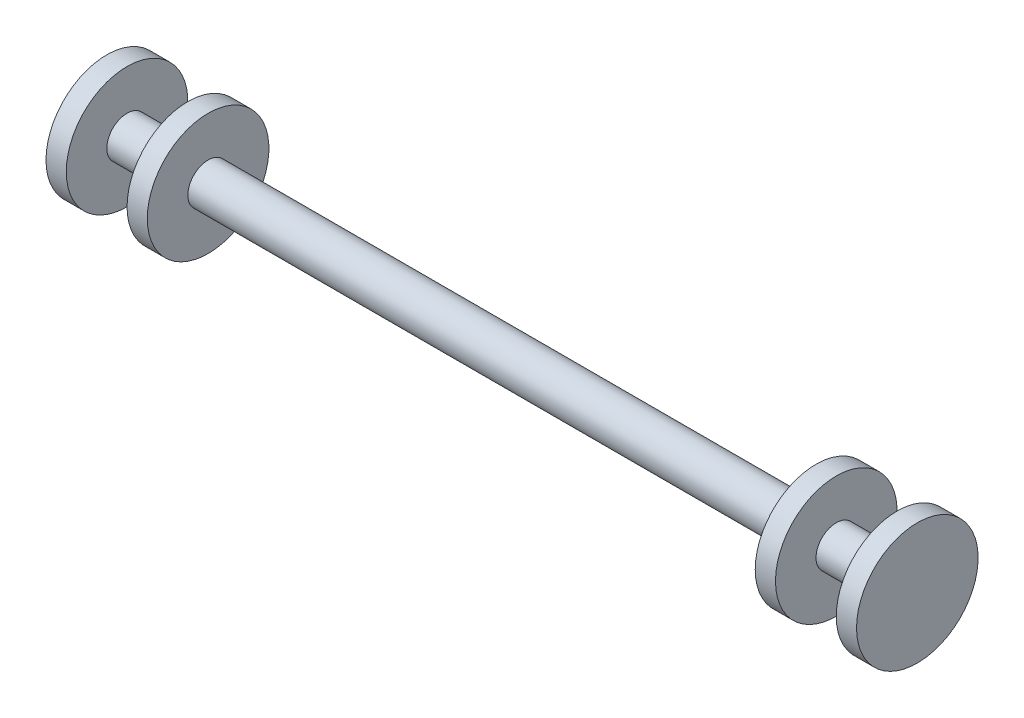
ISO-10303-21;
HEADER;
FILE_DESCRIPTION(('STEP AP214'),'2;1');
FILE_NAME('part.step','',(''),(''),'','','');
FILE_SCHEMA(('AUTOMOTIVE_DESIGN { 1 0 10303 214 1 1 1 1 }'));
ENDSEC;
DATA;
#1=APPLICATION_CONTEXT('core data for automotive mechanical design processes');
#2=APPLICATION_PROTOCOL_DEFINITION('international standard','automotive_design',2000,#1);
#3=PRODUCT_CONTEXT('',#1,'mechanical');
#4=PRODUCT('Part','Part','',(#3));
#5=PRODUCT_RELATED_PRODUCT_CATEGORY('part','',(#4));
#6=PRODUCT_DEFINITION_FORMATION('','',#4);
#7=PRODUCT_DEFINITION_CONTEXT('part definition',#1,'design');
#8=PRODUCT_DEFINITION('design','',#6,#7);
#9=PRODUCT_DEFINITION_SHAPE('','',#8);
#10=(LENGTH_UNIT() NAMED_UNIT(*) SI_UNIT(.MILLI.,.METRE.));
#11=(NAMED_UNIT(*) PLANE_ANGLE_UNIT() SI_UNIT($,.RADIAN.));
#12=(NAMED_UNIT(*) SI_UNIT($,.STERADIAN.) SOLID_ANGLE_UNIT());
#13=UNCERTAINTY_MEASURE_WITH_UNIT(LENGTH_MEASURE(1.E-05),#10,'distance_accuracy_value','');
#14=(GEOMETRIC_REPRESENTATION_CONTEXT(3) GLOBAL_UNCERTAINTY_ASSIGNED_CONTEXT((#13)) GLOBAL_UNIT_ASSIGNED_CONTEXT((#10,
#11,#12)) REPRESENTATION_CONTEXT('',''));
#15=CARTESIAN_POINT('',(0.,0.,0.));
#16=DIRECTION('',(0.,0.,1.));
#17=DIRECTION('',(1.,0.,0.));
#18=AXIS2_PLACEMENT_3D('',#15,#16,#17);
#19=CARTESIAN_POINT('',(-40.,4.,0.));
#20=DIRECTION('',(1.,0.,0.));
#21=DIRECTION('',(0.,0.,-1.));
#22=AXIS2_PLACEMENT_3D('',#19,#20,#21);
#23=PLANE('',#22);
#24=CARTESIAN_POINT('',(-40.,-2.00000000000001,0.));
#25=DIRECTION('',(-1.,0.,0.));
#26=DIRECTION('',(0.,0.,1.));
#27=AXIS2_PLACEMENT_3D('',#24,#25,#26);
#28=CIRCLE('',#27,6.00000000000001);
#29=CARTESIAN_POINT('',(-40.,-2.00000000000001,6.00000000000001));
#30=VERTEX_POINT('',#29);
#31=EDGE_CURVE('E10',#30,#30,#28,.T.);
#32=ORIENTED_EDGE('',*,*,#31,.T.);
#33=EDGE_LOOP('',(#32));
#34=FACE_BOUND('',#33,.T.);
#35=ADVANCED_FACE('F35',(#34),#23,.F.);
#36=CARTESIAN_POINT('',(-40.,-2.00000000000001,0.));
#37=DIRECTION('',(-1.,0.,0.));
#38=DIRECTION('',(0.,0.,1.));
#39=AXIS2_PLACEMENT_3D('',#36,#37,#38);
#40=CYLINDRICAL_SURFACE('',#39,6.00000000000001);
#41=ORIENTED_EDGE('',*,*,#31,.F.);
#42=EDGE_LOOP('',(#41));
#43=FACE_BOUND('',#42,.T.);
#44=CARTESIAN_POINT('',(-38.,-2.00000000000001,0.));
#45=DIRECTION('',(-1.,0.,0.));
#46=DIRECTION('',(0.,0.,1.));
#47=AXIS2_PLACEMENT_3D('',#44,#45,#46);
#48=CIRCLE('',#47,6.00000000000001);
#49=CARTESIAN_POINT('',(-38.,-2.00000000000001,6.00000000000001));
#50=VERTEX_POINT('',#49);
#51=EDGE_CURVE('E41',#50,#50,#48,.T.);
#52=ORIENTED_EDGE('',*,*,#51,.T.);
#53=EDGE_LOOP('',(#52));
#54=FACE_BOUND('',#53,.T.);
#55=ADVANCED_FACE('F97',(#43,#54),#40,.T.);
#56=CARTESIAN_POINT('',(-38.,0.,0.));
#57=DIRECTION('',(-1.,0.,0.));
#58=DIRECTION('',(0.,0.,1.));
#59=AXIS2_PLACEMENT_3D('',#56,#57,#58);
#60=PLANE('',#59);
#61=ORIENTED_EDGE('',*,*,#51,.F.);
#62=EDGE_LOOP('',(#61));
#63=FACE_BOUND('',#62,.T.);
#64=CARTESIAN_POINT('',(-38.,-2.00000000000001,0.));
#65=DIRECTION('',(-1.,0.,0.));
#66=DIRECTION('',(0.,0.,1.));
#67=AXIS2_PLACEMENT_3D('',#64,#65,#66);
#68=CIRCLE('',#67,2.00000000000001);
#69=CARTESIAN_POINT('',(-38.,-2.00000000000001,2.00000000000001));
#70=VERTEX_POINT('',#69);
#71=EDGE_CURVE('E45',#70,#70,#68,.T.);
#72=ORIENTED_EDGE('',*,*,#71,.T.);
#73=EDGE_LOOP('',(#72));
#74=FACE_BOUND('',#73,.T.);
#75=ADVANCED_FACE('F101',(#63,#74),#60,.F.);
#76=CARTESIAN_POINT('',(-40.,-2.00000000000001,0.));
#77=DIRECTION('',(-1.,0.,0.));
#78=DIRECTION('',(0.,0.,1.));
#79=AXIS2_PLACEMENT_3D('',#76,#77,#78);
#80=CYLINDRICAL_SURFACE('',#79,2.00000000000001);
#81=ORIENTED_EDGE('',*,*,#71,.F.);
#82=EDGE_LOOP('',(#81));
#83=FACE_BOUND('',#82,.T.);
#84=CARTESIAN_POINT('',(-32.,-2.00000000000001,0.));
#85=DIRECTION('',(-1.,0.,0.));
#86=DIRECTION('',(0.,0.,1.));
#87=AXIS2_PLACEMENT_3D('',#84,#85,#86);
#88=CIRCLE('',#87,2.00000000000001);
#89=CARTESIAN_POINT('',(-32.,-2.00000000000001,2.00000000000001));
#90=VERTEX_POINT('',#89);
#91=EDGE_CURVE('E49',#90,#90,#88,.T.);
#92=ORIENTED_EDGE('',*,*,#91,.T.);
#93=EDGE_LOOP('',(#92));
#94=FACE_BOUND('',#93,.T.);
#95=ADVANCED_FACE('F106',(#83,#94),#80,.T.);
#96=CARTESIAN_POINT('',(-32.,4.,0.));
#97=DIRECTION('',(1.,0.,0.));
#98=DIRECTION('',(0.,0.,-1.));
#99=AXIS2_PLACEMENT_3D('',#96,#97,#98);
#100=PLANE('',#99);
#101=ORIENTED_EDGE('',*,*,#91,.F.);
#102=EDGE_LOOP('',(#101));
#103=FACE_BOUND('',#102,.T.);
#104=CARTESIAN_POINT('',(-32.,-2.00000000000001,0.));
#105=DIRECTION('',(-1.,0.,0.));
#106=DIRECTION('',(0.,0.,1.));
#107=AXIS2_PLACEMENT_3D('',#104,#105,#106);
#108=CIRCLE('',#107,6.00000000000001);
#109=CARTESIAN_POINT('',(-32.,-2.00000000000001,6.00000000000001));
#110=VERTEX_POINT('',#109);
#111=EDGE_CURVE('E54',#110,#110,#108,.T.);
#112=ORIENTED_EDGE('',*,*,#111,.T.);
#113=EDGE_LOOP('',(#112));
#114=FACE_BOUND('',#113,.T.);
#115=ADVANCED_FACE('F112',(#103,#114),#100,.F.);
#116=CARTESIAN_POINT('',(-40.,-2.00000000000001,0.));
#117=DIRECTION('',(-1.,0.,0.));
#118=DIRECTION('',(0.,0.,1.));
#119=AXIS2_PLACEMENT_3D('',#116,#117,#118);
#120=CYLINDRICAL_SURFACE('',#119,6.00000000000001);
#121=ORIENTED_EDGE('',*,*,#111,.F.);
#122=EDGE_LOOP('',(#121));
#123=FACE_BOUND('',#122,.T.);
#124=CARTESIAN_POINT('',(-30.,-2.00000000000001,0.));
#125=DIRECTION('',(-1.,0.,0.));
#126=DIRECTION('',(0.,0.,1.));
#127=AXIS2_PLACEMENT_3D('',#124,#125,#126);
#128=CIRCLE('',#127,6.00000000000001);
#129=CARTESIAN_POINT('',(-30.,-2.00000000000001,6.00000000000001));
#130=VERTEX_POINT('',#129);
#131=EDGE_CURVE('E57',#130,#130,#128,.T.);
#132=ORIENTED_EDGE('',*,*,#131,.T.);
#133=EDGE_LOOP('',(#132));
#134=FACE_BOUND('',#133,.T.);
#135=ADVANCED_FACE('F116',(#123,#134),#120,.T.);
#136=CARTESIAN_POINT('',(-30.,0.,0.));
#137=DIRECTION('',(-1.,0.,0.));
#138=DIRECTION('',(0.,0.,1.));
#139=AXIS2_PLACEMENT_3D('',#136,#137,#138);
#140=PLANE('',#139);
#141=ORIENTED_EDGE('',*,*,#131,.F.);
#142=EDGE_LOOP('',(#141));
#143=FACE_BOUND('',#142,.T.);
#144=CARTESIAN_POINT('',(-30.,-2.00000000000001,0.));
#145=DIRECTION('',(-1.,0.,0.));
#146=DIRECTION('',(0.,0.,1.));
#147=AXIS2_PLACEMENT_3D('',#144,#145,#146);
#148=CIRCLE('',#147,2.);
#149=CARTESIAN_POINT('',(-30.,-2.00000000000001,2.));
#150=VERTEX_POINT('',#149);
#151=EDGE_CURVE('E60',#150,#150,#148,.T.);
#152=ORIENTED_EDGE('',*,*,#151,.T.);
#153=EDGE_LOOP('',(#152));
#154=FACE_BOUND('',#153,.T.);
#155=ADVANCED_FACE('F120',(#143,#154),#140,.F.);
#156=CARTESIAN_POINT('',(-40.,-2.00000000000001,0.));
#157=DIRECTION('',(-1.,0.,0.));
#158=DIRECTION('',(0.,0.,1.));
#159=AXIS2_PLACEMENT_3D('',#156,#157,#158);
#160=CYLINDRICAL_SURFACE('',#159,2.00000000000001);
#161=ORIENTED_EDGE('',*,*,#151,.F.);
#162=EDGE_LOOP('',(#161));
#163=FACE_BOUND('',#162,.T.);
#164=CARTESIAN_POINT('',(30.,-2.00000000000001,0.));
#165=DIRECTION('',(-1.,0.,0.));
#166=DIRECTION('',(0.,0.,1.));
#167=AXIS2_PLACEMENT_3D('',#164,#165,#166);
#168=CIRCLE('',#167,2.00000000000002);
#169=CARTESIAN_POINT('',(30.,-2.00000000000001,2.00000000000002));
#170=VERTEX_POINT('',#169);
#171=EDGE_CURVE('E63',#170,#170,#168,.T.);
#172=ORIENTED_EDGE('',*,*,#171,.T.);
#173=EDGE_LOOP('',(#172));
#174=FACE_BOUND('',#173,.T.);
#175=ADVANCED_FACE('F124',(#163,#174),#160,.T.);
#176=CARTESIAN_POINT('',(30.,0.,0.));
#177=DIRECTION('',(-1.,0.,0.));
#178=DIRECTION('',(0.,0.,1.));
#179=AXIS2_PLACEMENT_3D('',#176,#177,#178);
#180=PLANE('',#179);
#181=CARTESIAN_POINT('',(30.,-2.00000000000001,0.));
#182=DIRECTION('',(-1.,0.,0.));
#183=DIRECTION('',(0.,0.,1.));
#184=AXIS2_PLACEMENT_3D('',#181,#182,#183);
#185=CIRCLE('',#184,6.00000000000001);
#186=CARTESIAN_POINT('',(30.,-2.00000000000001,6.00000000000001));
#187=VERTEX_POINT('',#186);
#188=EDGE_CURVE('E66',#187,#187,#185,.T.);
#189=ORIENTED_EDGE('',*,*,#188,.T.);
#190=EDGE_LOOP('',(#189));
#191=FACE_BOUND('',#190,.T.);
#192=ORIENTED_EDGE('',*,*,#171,.F.);
#193=EDGE_LOOP('',(#192));
#194=FACE_BOUND('',#193,.T.);
#195=ADVANCED_FACE('F128',(#191,#194),#180,.T.);
#196=CARTESIAN_POINT('',(-40.,-2.00000000000001,0.));
#197=DIRECTION('',(-1.,0.,0.));
#198=DIRECTION('',(0.,0.,1.));
#199=AXIS2_PLACEMENT_3D('',#196,#197,#198);
#200=CYLINDRICAL_SURFACE('',#199,6.00000000000001);
#201=CARTESIAN_POINT('',(32.,-2.00000000000001,0.));
#202=DIRECTION('',(-1.,0.,0.));
#203=DIRECTION('',(0.,0.,1.));
#204=AXIS2_PLACEMENT_3D('',#201,#202,#203);
#205=CIRCLE('',#204,6.00000000000001);
#206=CARTESIAN_POINT('',(32.,-2.00000000000001,6.00000000000001));
#207=VERTEX_POINT('',#206);
#208=EDGE_CURVE('E69',#207,#207,#205,.T.);
#209=ORIENTED_EDGE('',*,*,#208,.T.);
#210=EDGE_LOOP('',(#209));
#211=FACE_BOUND('',#210,.T.);
#212=ORIENTED_EDGE('',*,*,#188,.F.);
#213=EDGE_LOOP('',(#212));
#214=FACE_BOUND('',#213,.T.);
#215=ADVANCED_FACE('F132',(#211,#214),#200,.T.);
#216=CARTESIAN_POINT('',(32.,4.,0.));
#217=DIRECTION('',(1.,0.,0.));
#218=DIRECTION('',(0.,0.,-1.));
#219=AXIS2_PLACEMENT_3D('',#216,#217,#218);
#220=PLANE('',#219);
#221=CARTESIAN_POINT('',(32.,-2.00000000000001,0.));
#222=DIRECTION('',(-1.,0.,0.));
#223=DIRECTION('',(0.,0.,1.));
#224=AXIS2_PLACEMENT_3D('',#221,#222,#223);
#225=CIRCLE('',#224,2.00000000000001);
#226=CARTESIAN_POINT('',(32.,-2.00000000000001,2.00000000000001));
#227=VERTEX_POINT('',#226);
#228=EDGE_CURVE('E72',#227,#227,#225,.T.);
#229=ORIENTED_EDGE('',*,*,#228,.T.);
#230=EDGE_LOOP('',(#229));
#231=FACE_BOUND('',#230,.T.);
#232=ORIENTED_EDGE('',*,*,#208,.F.);
#233=EDGE_LOOP('',(#232));
#234=FACE_BOUND('',#233,.T.);
#235=ADVANCED_FACE('F136',(#231,#234),#220,.T.);
#236=CARTESIAN_POINT('',(-40.,-2.00000000000001,0.));
#237=DIRECTION('',(-1.,0.,0.));
#238=DIRECTION('',(0.,0.,1.));
#239=AXIS2_PLACEMENT_3D('',#236,#237,#238);
#240=CYLINDRICAL_SURFACE('',#239,2.00000000000001);
#241=CARTESIAN_POINT('',(38.,-2.00000000000001,0.));
#242=DIRECTION('',(-1.,0.,0.));
#243=DIRECTION('',(0.,0.,1.));
#244=AXIS2_PLACEMENT_3D('',#241,#242,#243);
#245=CIRCLE('',#244,2.00000000000001);
#246=CARTESIAN_POINT('',(38.,-2.00000000000001,2.00000000000001));
#247=VERTEX_POINT('',#246);
#248=EDGE_CURVE('E75',#247,#247,#245,.T.);
#249=ORIENTED_EDGE('',*,*,#248,.T.);
#250=EDGE_LOOP('',(#249));
#251=FACE_BOUND('',#250,.T.);
#252=ORIENTED_EDGE('',*,*,#228,.F.);
#253=EDGE_LOOP('',(#252));
#254=FACE_BOUND('',#253,.T.);
#255=ADVANCED_FACE('F140',(#251,#254),#240,.T.);
#256=CARTESIAN_POINT('',(38.,0.,0.));
#257=DIRECTION('',(-1.,0.,0.));
#258=DIRECTION('',(0.,0.,1.));
#259=AXIS2_PLACEMENT_3D('',#256,#257,#258);
#260=PLANE('',#259);
#261=CARTESIAN_POINT('',(38.,-2.00000000000001,0.));
#262=DIRECTION('',(-1.,0.,0.));
#263=DIRECTION('',(0.,0.,1.));
#264=AXIS2_PLACEMENT_3D('',#261,#262,#263);
#265=CIRCLE('',#264,6.00000000000001);
#266=CARTESIAN_POINT('',(38.,-2.00000000000001,6.00000000000001));
#267=VERTEX_POINT('',#266);
#268=EDGE_CURVE('E78',#267,#267,#265,.T.);
#269=ORIENTED_EDGE('',*,*,#268,.T.);
#270=EDGE_LOOP('',(#269));
#271=FACE_BOUND('',#270,.T.);
#272=ORIENTED_EDGE('',*,*,#248,.F.);
#273=EDGE_LOOP('',(#272));
#274=FACE_BOUND('',#273,.T.);
#275=ADVANCED_FACE('F94',(#271,#274),#260,.T.);
#276=CARTESIAN_POINT('',(-40.,-2.00000000000001,0.));
#277=DIRECTION('',(-1.,0.,0.));
#278=DIRECTION('',(0.,0.,1.));
#279=AXIS2_PLACEMENT_3D('',#276,#277,#278);
#280=CYLINDRICAL_SURFACE('',#279,6.00000000000001);
#281=CARTESIAN_POINT('',(40.,-2.00000000000001,0.));
#282=DIRECTION('',(-1.,0.,0.));
#283=DIRECTION('',(0.,0.,1.));
#284=AXIS2_PLACEMENT_3D('',#281,#282,#283);
#285=CIRCLE('',#284,6.00000000000001);
#286=CARTESIAN_POINT('',(40.,-2.00000000000001,6.00000000000001));
#287=VERTEX_POINT('',#286);
#288=EDGE_CURVE('E81',#287,#287,#285,.T.);
#289=ORIENTED_EDGE('',*,*,#288,.T.);
#290=EDGE_LOOP('',(#289));
#291=FACE_BOUND('',#290,.T.);
#292=ORIENTED_EDGE('',*,*,#268,.F.);
#293=EDGE_LOOP('',(#292));
#294=FACE_BOUND('',#293,.T.);
#295=ADVANCED_FACE('F85',(#291,#294),#280,.T.);
#296=CARTESIAN_POINT('',(40.,0.,0.));
#297=DIRECTION('',(1.,0.,0.));
#298=DIRECTION('',(0.,0.,-1.));
#299=AXIS2_PLACEMENT_3D('',#296,#297,#298);
#300=PLANE('',#299);
#301=ORIENTED_EDGE('',*,*,#288,.F.);
#302=EDGE_LOOP('',(#301));
#303=FACE_BOUND('',#302,.T.);
#304=ADVANCED_FACE('F88',(#303),#300,.T.);
#305=CLOSED_SHELL('',(#35,#55,#75,#95,#115,#135,#155,#175,#195,#215,#235,#255,#275,#295,#304));
#306=MANIFOLD_SOLID_BREP('B2',#305);
#307=ADVANCED_BREP_SHAPE_REPRESENTATION('',(#18,#306),#14);
#308=SHAPE_DEFINITION_REPRESENTATION(#9,#307);
ENDSEC;
END-ISO-10303-21;
